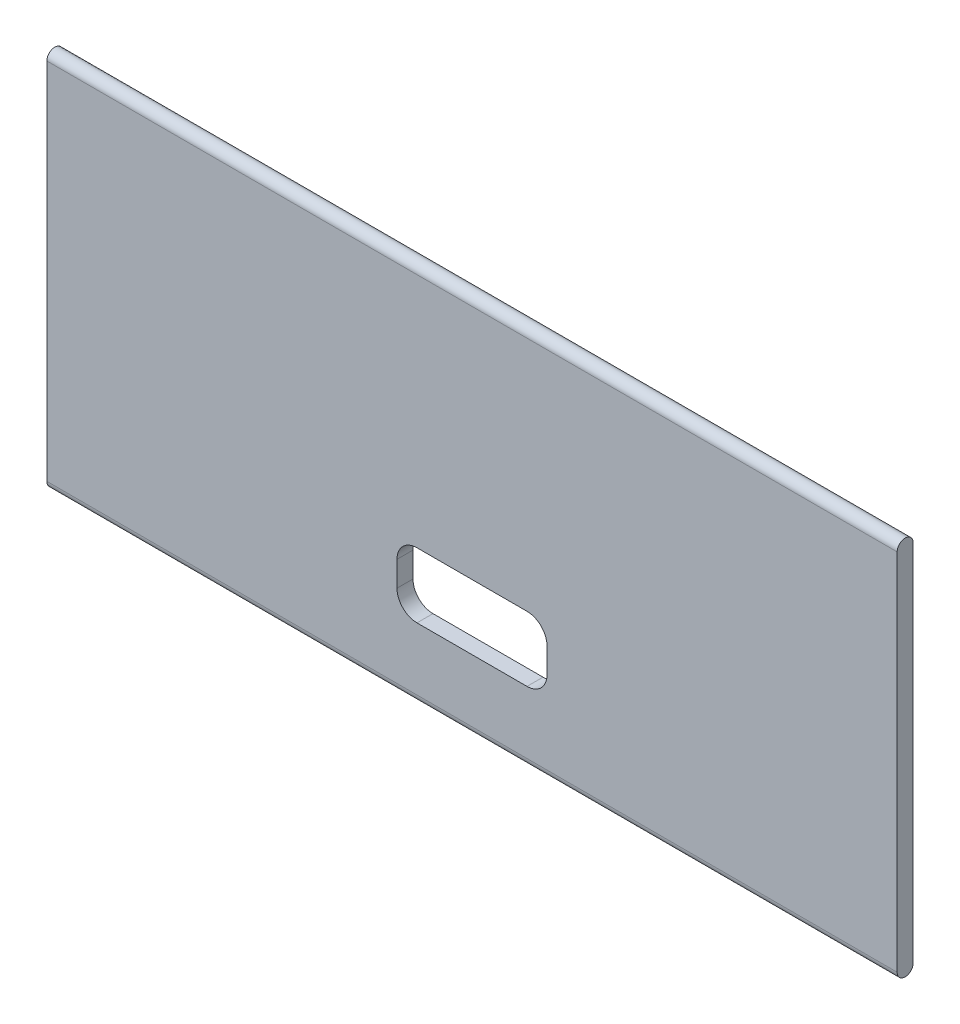
ISO-10303-21;
HEADER;
FILE_DESCRIPTION(('STEP AP214'),'2;1');
FILE_NAME('part.step','',(''),(''),'','','');
FILE_SCHEMA(('AUTOMOTIVE_DESIGN { 1 0 10303 214 1 1 1 1 }'));
ENDSEC;
DATA;
#1=APPLICATION_CONTEXT('core data for automotive mechanical design processes');
#2=APPLICATION_PROTOCOL_DEFINITION('international standard','automotive_design',2000,#1);
#3=PRODUCT_CONTEXT('',#1,'mechanical');
#4=PRODUCT('Part','Part','',(#3));
#5=PRODUCT_RELATED_PRODUCT_CATEGORY('part','',(#4));
#6=PRODUCT_DEFINITION_FORMATION('','',#4);
#7=PRODUCT_DEFINITION_CONTEXT('part definition',#1,'design');
#8=PRODUCT_DEFINITION('design','',#6,#7);
#9=PRODUCT_DEFINITION_SHAPE('','',#8);
#10=(LENGTH_UNIT() NAMED_UNIT(*) SI_UNIT(.MILLI.,.METRE.));
#11=(NAMED_UNIT(*) PLANE_ANGLE_UNIT() SI_UNIT($,.RADIAN.));
#12=(NAMED_UNIT(*) SI_UNIT($,.STERADIAN.) SOLID_ANGLE_UNIT());
#13=UNCERTAINTY_MEASURE_WITH_UNIT(LENGTH_MEASURE(1.E-05),#10,'distance_accuracy_value','');
#14=(GEOMETRIC_REPRESENTATION_CONTEXT(3) GLOBAL_UNCERTAINTY_ASSIGNED_CONTEXT((#13)) GLOBAL_UNIT_ASSIGNED_CONTEXT((#10,
#11,#12)) REPRESENTATION_CONTEXT('',''));
#15=CARTESIAN_POINT('',(0.,0.,0.));
#16=DIRECTION('',(0.,0.,1.));
#17=DIRECTION('',(1.,0.,0.));
#18=AXIS2_PLACEMENT_3D('',#15,#16,#17);
#19=CARTESIAN_POINT('',(85.,18.1971911252526,-9.93196580534317E-06));
#20=DIRECTION('',(-1.,0.,0.));
#21=DIRECTION('',(0.,0.,1.));
#22=AXIS2_PLACEMENT_3D('',#19,#20,#21);
#23=CYLINDRICAL_SURFACE('',#22,0.799999999999999);
#24=CARTESIAN_POINT('',(0.,18.1971911252526,-9.93196580534317E-06));
#25=DIRECTION('',(1.,0.,0.));
#26=DIRECTION('',(0.,0.,-1.));
#27=AXIS2_PLACEMENT_3D('',#24,#25,#26);
#28=CIRCLE('',#27,0.799999999999999);
#29=CARTESIAN_POINT('',(0.,18.1971911252526,-0.800009931965804));
#30=VERTEX_POINT('',#29);
#31=CARTESIAN_POINT('',(0.,18.1971911252526,0.799990068034193));
#32=VERTEX_POINT('',#31);
#33=EDGE_CURVE('E148',#30,#32,#28,.T.);
#34=ORIENTED_EDGE('',*,*,#33,.T.);
#35=DIRECTION('',(-1.,0.,0.));
#36=VECTOR('',#35,1.);
#37=CARTESIAN_POINT('',(85.,18.1971911252526,0.799990068034193));
#38=LINE('',#37,#36);
#39=CARTESIAN_POINT('',(85.,18.1971911252526,0.799990068034193));
#40=VERTEX_POINT('',#39);
#41=EDGE_CURVE('E51',#40,#32,#38,.T.);
#42=ORIENTED_EDGE('',*,*,#41,.F.);
#43=CARTESIAN_POINT('',(85.,18.1971911252526,-9.93196580534317E-06));
#44=DIRECTION('',(1.,0.,0.));
#45=DIRECTION('',(0.,0.,-1.));
#46=AXIS2_PLACEMENT_3D('',#43,#44,#45);
#47=CIRCLE('',#46,0.799999999999999);
#48=CARTESIAN_POINT('',(85.,18.1971911252526,-0.800009931965804));
#49=VERTEX_POINT('',#48);
#50=EDGE_CURVE('E214',#49,#40,#47,.T.);
#51=ORIENTED_EDGE('',*,*,#50,.F.);
#52=DIRECTION('',(-1.,0.,0.));
#53=VECTOR('',#52,1.);
#54=CARTESIAN_POINT('',(85.,18.1971911252526,-0.800009931965804));
#55=LINE('',#54,#53);
#56=EDGE_CURVE('E11',#49,#30,#55,.T.);
#57=ORIENTED_EDGE('',*,*,#56,.T.);
#58=EDGE_LOOP('',(#34,#42,#51,#57));
#59=FACE_BOUND('',#58,.T.);
#60=ADVANCED_FACE('F43',(#59),#23,.T.);
#61=CARTESIAN_POINT('',(85.,18.1971911252526,0.799990068034193));
#62=DIRECTION('',(0.,0.,-1.));
#63=DIRECTION('',(0.,1.,0.));
#64=AXIS2_PLACEMENT_3D('',#61,#62,#63);
#65=PLANE('',#64);
#66=DIRECTION('',(0.,-1.,0.));
#67=VECTOR('',#66,1.);
#68=CARTESIAN_POINT('',(35.,-7.44717126132102,0.799990068034195));
#69=LINE('',#68,#67);
#70=CARTESIAN_POINT('',(35.,-7.44717126132102,0.799990068034196));
#71=VERTEX_POINT('',#70);
#72=CARTESIAN_POINT('',(35.,-9.94717126132102,0.799990068034195));
#73=VERTEX_POINT('',#72);
#74=EDGE_CURVE('E160',#71,#73,#69,.T.);
#75=ORIENTED_EDGE('',*,*,#74,.F.);
#76=CARTESIAN_POINT('',(37.,-7.44717126132102,0.799990068034195));
#77=DIRECTION('',(0.,0.,1.));
#78=DIRECTION('',(1.,0.,0.));
#79=AXIS2_PLACEMENT_3D('',#76,#77,#78);
#80=CIRCLE('',#79,2.);
#81=CARTESIAN_POINT('',(37.,-5.44717126132102,0.799990068034195));
#82=VERTEX_POINT('',#81);
#83=EDGE_CURVE('E58',#82,#71,#80,.T.);
#84=ORIENTED_EDGE('',*,*,#83,.F.);
#85=DIRECTION('',(-1.,0.,0.));
#86=VECTOR('',#85,1.);
#87=CARTESIAN_POINT('',(37.,-5.44717126132102,0.799990068034195));
#88=LINE('',#87,#86);
#89=CARTESIAN_POINT('',(48.,-5.44717126132102,0.799990068034195));
#90=VERTEX_POINT('',#89);
#91=EDGE_CURVE('E141',#90,#82,#88,.T.);
#92=ORIENTED_EDGE('',*,*,#91,.F.);
#93=CARTESIAN_POINT('',(48.,-7.44717126132102,0.799990068034195));
#94=DIRECTION('',(0.,0.,1.));
#95=DIRECTION('',(-1.,0.,0.));
#96=AXIS2_PLACEMENT_3D('',#93,#94,#95);
#97=CIRCLE('',#96,2.);
#98=CARTESIAN_POINT('',(50.,-7.44717126132102,0.799990068034195));
#99=VERTEX_POINT('',#98);
#100=EDGE_CURVE('E184',#99,#90,#97,.T.);
#101=ORIENTED_EDGE('',*,*,#100,.F.);
#102=DIRECTION('',(0.,1.,0.));
#103=VECTOR('',#102,1.);
#104=CARTESIAN_POINT('',(50.,-7.44717126132102,0.799990068034195));
#105=LINE('',#104,#103);
#106=CARTESIAN_POINT('',(50.,-9.94717126132102,0.799990068034195));
#107=VERTEX_POINT('',#106);
#108=EDGE_CURVE('E180',#107,#99,#105,.T.);
#109=ORIENTED_EDGE('',*,*,#108,.F.);
#110=CARTESIAN_POINT('',(48.,-9.94717126132102,0.799990068034195));
#111=DIRECTION('',(0.,0.,1.));
#112=DIRECTION('',(1.,0.,0.));
#113=AXIS2_PLACEMENT_3D('',#110,#111,#112);
#114=CIRCLE('',#113,2.);
#115=CARTESIAN_POINT('',(48.,-11.947171261321,0.799990068034195));
#116=VERTEX_POINT('',#115);
#117=EDGE_CURVE('E176',#116,#107,#114,.T.);
#118=ORIENTED_EDGE('',*,*,#117,.F.);
#119=DIRECTION('',(1.,0.,0.));
#120=VECTOR('',#119,1.);
#121=CARTESIAN_POINT('',(37.,-11.947171261321,0.799990068034195));
#122=LINE('',#121,#120);
#123=CARTESIAN_POINT('',(37.,-11.947171261321,0.799990068034195));
#124=VERTEX_POINT('',#123);
#125=EDGE_CURVE('E172',#124,#116,#122,.T.);
#126=ORIENTED_EDGE('',*,*,#125,.F.);
#127=CARTESIAN_POINT('',(37.,-9.94717126132102,0.799990068034195));
#128=DIRECTION('',(0.,0.,1.));
#129=DIRECTION('',(1.,0.,0.));
#130=AXIS2_PLACEMENT_3D('',#127,#128,#129);
#131=CIRCLE('',#130,2.);
#132=EDGE_CURVE('E168',#73,#124,#131,.T.);
#133=ORIENTED_EDGE('',*,*,#132,.F.);
#134=EDGE_LOOP('',(#75,#84,#92,#101,#109,#118,#126,#133));
#135=FACE_BOUND('',#134,.T.);
#136=DIRECTION('',(0.,-1.,0.));
#137=VECTOR('',#136,1.);
#138=CARTESIAN_POINT('',(0.,18.1971911252526,0.799990068034193));
#139=LINE('',#138,#137);
#140=CARTESIAN_POINT('',(0.,-18.1915336478947,0.799990068034195));
#141=VERTEX_POINT('',#140);
#142=EDGE_CURVE('E228',#32,#141,#139,.T.);
#143=ORIENTED_EDGE('',*,*,#142,.T.);
#144=DIRECTION('',(-1.,0.,0.));
#145=VECTOR('',#144,1.);
#146=CARTESIAN_POINT('',(85.,-18.1915336478947,0.799990068034195));
#147=LINE('',#146,#145);
#148=CARTESIAN_POINT('',(85.,-18.1915336478947,0.799990068034195));
#149=VERTEX_POINT('',#148);
#150=EDGE_CURVE('E239',#149,#141,#147,.T.);
#151=ORIENTED_EDGE('',*,*,#150,.F.);
#152=DIRECTION('',(0.,-1.,0.));
#153=VECTOR('',#152,1.);
#154=CARTESIAN_POINT('',(85.,18.1971911252526,0.799990068034193));
#155=LINE('',#154,#153);
#156=EDGE_CURVE('E218',#40,#149,#155,.T.);
#157=ORIENTED_EDGE('',*,*,#156,.F.);
#158=ORIENTED_EDGE('',*,*,#41,.T.);
#159=EDGE_LOOP('',(#143,#151,#157,#158));
#160=FACE_BOUND('',#159,.T.);
#161=ADVANCED_FACE('F248',(#135,#160),#65,.F.);
#162=CARTESIAN_POINT('',(85.,-18.197171261321,-9.93196580534317E-06));
#163=DIRECTION('',(-1.,0.,0.));
#164=DIRECTION('',(0.,0.,1.));
#165=AXIS2_PLACEMENT_3D('',#162,#163,#164);
#166=CYLINDRICAL_SURFACE('',#165,0.800019863931606);
#167=CARTESIAN_POINT('',(0.,-18.197171261321,-9.93196580534317E-06));
#168=DIRECTION('',(1.,0.,0.));
#169=DIRECTION('',(0.,0.,1.));
#170=AXIS2_PLACEMENT_3D('',#167,#168,#169);
#171=CIRCLE('',#170,0.800019863931606);
#172=CARTESIAN_POINT('',(0.,-18.2028088747474,-0.800009931965804));
#173=VERTEX_POINT('',#172);
#174=EDGE_CURVE('E231',#141,#173,#171,.T.);
#175=ORIENTED_EDGE('',*,*,#174,.T.);
#176=DIRECTION('',(-1.,0.,0.));
#177=VECTOR('',#176,1.);
#178=CARTESIAN_POINT('',(85.,-18.2028088747474,-0.800009931965804));
#179=LINE('',#178,#177);
#180=CARTESIAN_POINT('',(85.,-18.2028088747474,-0.800009931965804));
#181=VERTEX_POINT('',#180);
#182=EDGE_CURVE('E225',#181,#173,#179,.T.);
#183=ORIENTED_EDGE('',*,*,#182,.F.);
#184=CARTESIAN_POINT('',(85.,-18.197171261321,-9.93196580534317E-06));
#185=DIRECTION('',(1.,0.,0.));
#186=DIRECTION('',(0.,0.,1.));
#187=AXIS2_PLACEMENT_3D('',#184,#185,#186);
#188=CIRCLE('',#187,0.800019863931606);
#189=EDGE_CURVE('E221',#149,#181,#188,.T.);
#190=ORIENTED_EDGE('',*,*,#189,.F.);
#191=ORIENTED_EDGE('',*,*,#150,.T.);
#192=EDGE_LOOP('',(#175,#183,#190,#191));
#193=FACE_BOUND('',#192,.T.);
#194=ADVANCED_FACE('F258',(#193),#166,.T.);
#195=CARTESIAN_POINT('',(85.,17.2084663521053,-0.800009931965801));
#196=DIRECTION('',(0.,0.,1.));
#197=DIRECTION('',(0.,-1.,0.));
#198=AXIS2_PLACEMENT_3D('',#195,#196,#197);
#199=PLANE('',#198);
#200=DIRECTION('',(1.,0.,0.));
#201=VECTOR('',#200,1.);
#202=CARTESIAN_POINT('',(37.,-5.44717126132102,-0.800009931965803));
#203=LINE('',#202,#201);
#204=CARTESIAN_POINT('',(37.,-5.44717126132102,-0.800009931965803));
#205=VERTEX_POINT('',#204);
#206=CARTESIAN_POINT('',(48.,-5.44717126132102,-0.800009931965803));
#207=VERTEX_POINT('',#206);
#208=EDGE_CURVE('E155',#205,#207,#203,.T.);
#209=ORIENTED_EDGE('',*,*,#208,.F.);
#210=CARTESIAN_POINT('',(37.,-7.44717126132102,-0.800009931965803));
#211=DIRECTION('',(0.,0.,1.));
#212=DIRECTION('',(0.,-1.,0.));
#213=AXIS2_PLACEMENT_3D('',#210,#211,#212);
#214=CIRCLE('',#213,2.);
#215=CARTESIAN_POINT('',(35.,-7.44717126132102,-0.800009931965803));
#216=VERTEX_POINT('',#215);
#217=EDGE_CURVE('E134',#216,#205,#214,.F.);
#218=ORIENTED_EDGE('',*,*,#217,.F.);
#219=DIRECTION('',(0.,1.,0.));
#220=VECTOR('',#219,1.);
#221=CARTESIAN_POINT('',(35.,-7.44717126132102,-0.800009931965803));
#222=LINE('',#221,#220);
#223=CARTESIAN_POINT('',(35.,-9.94717126132102,-0.800009931965803));
#224=VERTEX_POINT('',#223);
#225=EDGE_CURVE('E144',#224,#216,#222,.T.);
#226=ORIENTED_EDGE('',*,*,#225,.F.);
#227=CARTESIAN_POINT('',(37.,-9.94717126132102,-0.800009931965803));
#228=DIRECTION('',(0.,0.,1.));
#229=DIRECTION('',(0.,-1.,0.));
#230=AXIS2_PLACEMENT_3D('',#227,#228,#229);
#231=CIRCLE('',#230,2.);
#232=CARTESIAN_POINT('',(37.,-11.947171261321,-0.800009931965803));
#233=VERTEX_POINT('',#232);
#234=EDGE_CURVE('E66',#233,#224,#231,.F.);
#235=ORIENTED_EDGE('',*,*,#234,.F.);
#236=DIRECTION('',(-1.,0.,0.));
#237=VECTOR('',#236,1.);
#238=CARTESIAN_POINT('',(37.,-11.947171261321,-0.800009931965803));
#239=LINE('',#238,#237);
#240=CARTESIAN_POINT('',(48.,-11.947171261321,-0.800009931965803));
#241=VERTEX_POINT('',#240);
#242=EDGE_CURVE('E320',#241,#233,#239,.T.);
#243=ORIENTED_EDGE('',*,*,#242,.F.);
#244=CARTESIAN_POINT('',(48.,-9.94717126132102,-0.800009931965803));
#245=DIRECTION('',(0.,0.,1.));
#246=DIRECTION('',(0.,-1.,0.));
#247=AXIS2_PLACEMENT_3D('',#244,#245,#246);
#248=CIRCLE('',#247,2.);
#249=CARTESIAN_POINT('',(50.,-9.94717126132102,-0.800009931965803));
#250=VERTEX_POINT('',#249);
#251=EDGE_CURVE('E314',#250,#241,#248,.F.);
#252=ORIENTED_EDGE('',*,*,#251,.F.);
#253=DIRECTION('',(0.,-1.,0.));
#254=VECTOR('',#253,1.);
#255=CARTESIAN_POINT('',(50.,-7.44717126132102,-0.800009931965803));
#256=LINE('',#255,#254);
#257=CARTESIAN_POINT('',(50.,-7.44717126132102,-0.800009931965803));
#258=VERTEX_POINT('',#257);
#259=EDGE_CURVE('E311',#258,#250,#256,.T.);
#260=ORIENTED_EDGE('',*,*,#259,.F.);
#261=CARTESIAN_POINT('',(48.,-7.44717126132102,-0.800009931965803));
#262=DIRECTION('',(0.,0.,1.));
#263=DIRECTION('',(0.,-1.,0.));
#264=AXIS2_PLACEMENT_3D('',#261,#262,#263);
#265=CIRCLE('',#264,2.);
#266=EDGE_CURVE('E162',#207,#258,#265,.F.);
#267=ORIENTED_EDGE('',*,*,#266,.F.);
#268=EDGE_LOOP('',(#209,#218,#226,#235,#243,#252,#260,#267));
#269=FACE_BOUND('',#268,.T.);
#270=DIRECTION('',(0.,1.,0.));
#271=VECTOR('',#270,1.);
#272=CARTESIAN_POINT('',(0.,17.2084663521053,-0.800009931965801));
#273=LINE('',#272,#271);
#274=EDGE_CURVE('E215',#173,#30,#273,.T.);
#275=ORIENTED_EDGE('',*,*,#274,.T.);
#276=ORIENTED_EDGE('',*,*,#56,.F.);
#277=DIRECTION('',(0.,1.,0.));
#278=VECTOR('',#277,1.);
#279=CARTESIAN_POINT('',(85.,17.2084663521053,-0.800009931965801));
#280=LINE('',#279,#278);
#281=EDGE_CURVE('E210',#181,#49,#280,.T.);
#282=ORIENTED_EDGE('',*,*,#281,.F.);
#283=ORIENTED_EDGE('',*,*,#182,.T.);
#284=EDGE_LOOP('',(#275,#276,#282,#283));
#285=FACE_BOUND('',#284,.T.);
#286=ADVANCED_FACE('F151',(#269,#285),#199,.F.);
#287=CARTESIAN_POINT('',(85.,18.1971911252526,-9.93196580534317E-06));
#288=DIRECTION('',(1.,0.,0.));
#289=DIRECTION('',(0.,0.,-1.));
#290=AXIS2_PLACEMENT_3D('',#287,#288,#289);
#291=PLANE('',#290);
#292=ORIENTED_EDGE('',*,*,#281,.T.);
#293=ORIENTED_EDGE('',*,*,#50,.T.);
#294=ORIENTED_EDGE('',*,*,#156,.T.);
#295=ORIENTED_EDGE('',*,*,#189,.T.);
#296=EDGE_LOOP('',(#292,#293,#294,#295));
#297=FACE_BOUND('',#296,.T.);
#298=ADVANCED_FACE('F262',(#297),#291,.T.);
#299=CARTESIAN_POINT('',(0.,18.1971911252526,-9.93196580534317E-06));
#300=DIRECTION('',(1.,0.,0.));
#301=DIRECTION('',(0.,0.,-1.));
#302=AXIS2_PLACEMENT_3D('',#299,#300,#301);
#303=PLANE('',#302);
#304=ORIENTED_EDGE('',*,*,#33,.F.);
#305=ORIENTED_EDGE('',*,*,#274,.F.);
#306=ORIENTED_EDGE('',*,*,#174,.F.);
#307=ORIENTED_EDGE('',*,*,#142,.F.);
#308=EDGE_LOOP('',(#304,#305,#306,#307));
#309=FACE_BOUND('',#308,.T.);
#310=ADVANCED_FACE('F254',(#309),#303,.F.);
#311=CARTESIAN_POINT('',(37.,-7.44717126132102,-0.801009931965804));
#312=DIRECTION('',(0.,0.,1.));
#313=DIRECTION('',(1.,0.,0.));
#314=AXIS2_PLACEMENT_3D('',#311,#312,#313);
#315=CYLINDRICAL_SURFACE('',#314,2.);
#316=ORIENTED_EDGE('',*,*,#217,.T.);
#317=DIRECTION('',(0.,0.,1.));
#318=VECTOR('',#317,1.);
#319=CARTESIAN_POINT('',(37.,-5.44717126132102,-0.801009931965804));
#320=LINE('',#319,#318);
#321=EDGE_CURVE('E149',#205,#82,#320,.T.);
#322=ORIENTED_EDGE('',*,*,#321,.T.);
#323=ORIENTED_EDGE('',*,*,#83,.T.);
#324=DIRECTION('',(0.,0.,1.));
#325=VECTOR('',#324,1.);
#326=CARTESIAN_POINT('',(35.,-7.44717126132102,-0.801009931965804));
#327=LINE('',#326,#325);
#328=EDGE_CURVE('E130',#216,#71,#327,.T.);
#329=ORIENTED_EDGE('',*,*,#328,.F.);
#330=EDGE_LOOP('',(#316,#322,#323,#329));
#331=FACE_BOUND('',#330,.T.);
#332=ADVANCED_FACE('F132',(#331),#315,.F.);
#333=CARTESIAN_POINT('',(37.,-5.44717126132102,-0.801009931965804));
#334=DIRECTION('',(0.,1.,0.));
#335=DIRECTION('',(0.,0.,1.));
#336=AXIS2_PLACEMENT_3D('',#333,#334,#335);
#337=PLANE('',#336);
#338=ORIENTED_EDGE('',*,*,#208,.T.);
#339=DIRECTION('',(0.,0.,1.));
#340=VECTOR('',#339,1.);
#341=CARTESIAN_POINT('',(48.,-5.44717126132102,-0.801009931965804));
#342=LINE('',#341,#340);
#343=EDGE_CURVE('E193',#207,#90,#342,.T.);
#344=ORIENTED_EDGE('',*,*,#343,.T.);
#345=ORIENTED_EDGE('',*,*,#91,.T.);
#346=ORIENTED_EDGE('',*,*,#321,.F.);
#347=EDGE_LOOP('',(#338,#344,#345,#346));
#348=FACE_BOUND('',#347,.T.);
#349=ADVANCED_FACE('F281',(#348),#337,.F.);
#350=CARTESIAN_POINT('',(48.,-7.44717126132102,-0.801009931965804));
#351=DIRECTION('',(0.,0.,1.));
#352=DIRECTION('',(1.,0.,0.));
#353=AXIS2_PLACEMENT_3D('',#350,#351,#352);
#354=CYLINDRICAL_SURFACE('',#353,2.);
#355=ORIENTED_EDGE('',*,*,#266,.T.);
#356=DIRECTION('',(0.,0.,1.));
#357=VECTOR('',#356,1.);
#358=CARTESIAN_POINT('',(50.,-7.44717126132102,-0.801009931965804));
#359=LINE('',#358,#357);
#360=EDGE_CURVE('E196',#258,#99,#359,.T.);
#361=ORIENTED_EDGE('',*,*,#360,.T.);
#362=ORIENTED_EDGE('',*,*,#100,.T.);
#363=ORIENTED_EDGE('',*,*,#343,.F.);
#364=EDGE_LOOP('',(#355,#361,#362,#363));
#365=FACE_BOUND('',#364,.T.);
#366=ADVANCED_FACE('F298',(#365),#354,.F.);
#367=CARTESIAN_POINT('',(50.,-7.44717126132102,-0.801009931965804));
#368=DIRECTION('',(1.,0.,0.));
#369=DIRECTION('',(0.,0.,-1.));
#370=AXIS2_PLACEMENT_3D('',#367,#368,#369);
#371=PLANE('',#370);
#372=ORIENTED_EDGE('',*,*,#259,.T.);
#373=DIRECTION('',(0.,0.,1.));
#374=VECTOR('',#373,1.);
#375=CARTESIAN_POINT('',(50.,-9.94717126132102,-0.801009931965804));
#376=LINE('',#375,#374);
#377=EDGE_CURVE('E199',#250,#107,#376,.T.);
#378=ORIENTED_EDGE('',*,*,#377,.T.);
#379=ORIENTED_EDGE('',*,*,#108,.T.);
#380=ORIENTED_EDGE('',*,*,#360,.F.);
#381=EDGE_LOOP('',(#372,#378,#379,#380));
#382=FACE_BOUND('',#381,.T.);
#383=ADVANCED_FACE('F294',(#382),#371,.F.);
#384=CARTESIAN_POINT('',(48.,-9.94717126132102,-0.801009931965804));
#385=DIRECTION('',(0.,0.,1.));
#386=DIRECTION('',(1.,0.,0.));
#387=AXIS2_PLACEMENT_3D('',#384,#385,#386);
#388=CYLINDRICAL_SURFACE('',#387,2.);
#389=ORIENTED_EDGE('',*,*,#251,.T.);
#390=DIRECTION('',(0.,0.,1.));
#391=VECTOR('',#390,1.);
#392=CARTESIAN_POINT('',(48.,-11.947171261321,-0.801009931965804));
#393=LINE('',#392,#391);
#394=EDGE_CURVE('E202',#241,#116,#393,.T.);
#395=ORIENTED_EDGE('',*,*,#394,.T.);
#396=ORIENTED_EDGE('',*,*,#117,.T.);
#397=ORIENTED_EDGE('',*,*,#377,.F.);
#398=EDGE_LOOP('',(#389,#395,#396,#397));
#399=FACE_BOUND('',#398,.T.);
#400=ADVANCED_FACE('F290',(#399),#388,.F.);
#401=CARTESIAN_POINT('',(37.,-11.947171261321,-0.801009931965804));
#402=DIRECTION('',(0.,-1.,0.));
#403=DIRECTION('',(0.,0.,-1.));
#404=AXIS2_PLACEMENT_3D('',#401,#402,#403);
#405=PLANE('',#404);
#406=ORIENTED_EDGE('',*,*,#242,.T.);
#407=DIRECTION('',(0.,0.,1.));
#408=VECTOR('',#407,1.);
#409=CARTESIAN_POINT('',(37.,-11.947171261321,-0.801009931965804));
#410=LINE('',#409,#408);
#411=EDGE_CURVE('E205',#233,#124,#410,.T.);
#412=ORIENTED_EDGE('',*,*,#411,.T.);
#413=ORIENTED_EDGE('',*,*,#125,.T.);
#414=ORIENTED_EDGE('',*,*,#394,.F.);
#415=EDGE_LOOP('',(#406,#412,#413,#414));
#416=FACE_BOUND('',#415,.T.);
#417=ADVANCED_FACE('F287',(#416),#405,.F.);
#418=CARTESIAN_POINT('',(37.,-9.94717126132102,-0.801009931965804));
#419=DIRECTION('',(0.,0.,1.));
#420=DIRECTION('',(1.,0.,0.));
#421=AXIS2_PLACEMENT_3D('',#418,#419,#420);
#422=CYLINDRICAL_SURFACE('',#421,2.);
#423=ORIENTED_EDGE('',*,*,#234,.T.);
#424=DIRECTION('',(0.,0.,1.));
#425=VECTOR('',#424,1.);
#426=CARTESIAN_POINT('',(35.,-9.94717126132102,-0.801009931965804));
#427=LINE('',#426,#425);
#428=EDGE_CURVE('E140',#224,#73,#427,.T.);
#429=ORIENTED_EDGE('',*,*,#428,.T.);
#430=ORIENTED_EDGE('',*,*,#132,.T.);
#431=ORIENTED_EDGE('',*,*,#411,.F.);
#432=EDGE_LOOP('',(#423,#429,#430,#431));
#433=FACE_BOUND('',#432,.T.);
#434=ADVANCED_FACE('F284',(#433),#422,.F.);
#435=CARTESIAN_POINT('',(35.,-7.44717126132102,-0.801009931965804));
#436=DIRECTION('',(-1.,0.,0.));
#437=DIRECTION('',(0.,0.,1.));
#438=AXIS2_PLACEMENT_3D('',#435,#436,#437);
#439=PLANE('',#438);
#440=ORIENTED_EDGE('',*,*,#225,.T.);
#441=ORIENTED_EDGE('',*,*,#328,.T.);
#442=ORIENTED_EDGE('',*,*,#74,.T.);
#443=ORIENTED_EDGE('',*,*,#428,.F.);
#444=EDGE_LOOP('',(#440,#441,#442,#443));
#445=FACE_BOUND('',#444,.T.);
#446=ADVANCED_FACE('F145',(#445),#439,.F.);
#447=CLOSED_SHELL('',(#60,#161,#194,#286,#298,#310,#332,#349,#366,#383,#400,#417,#434,#446));
#448=MANIFOLD_SOLID_BREP('B2',#447);
#449=ADVANCED_BREP_SHAPE_REPRESENTATION('',(#18,#448),#14);
#450=SHAPE_DEFINITION_REPRESENTATION(#9,#449);
ENDSEC;
END-ISO-10303-21;
